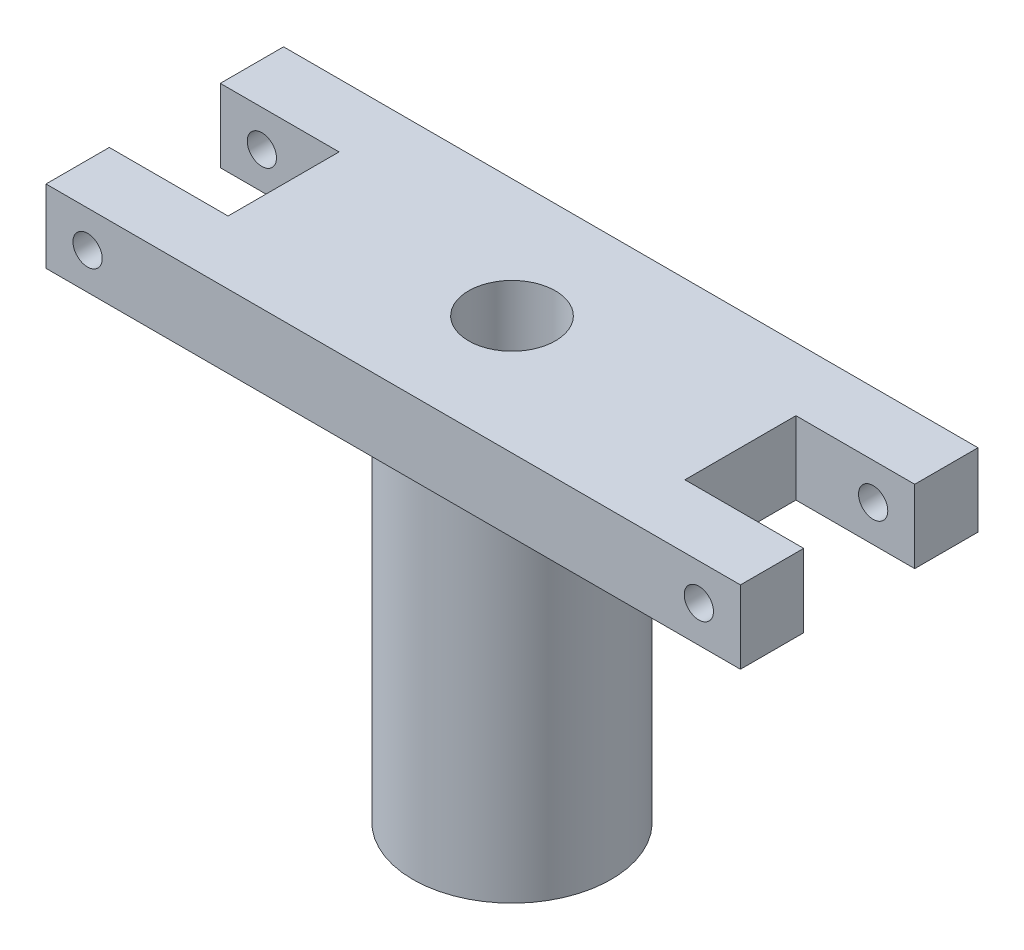
ISO-10303-21;
HEADER;
FILE_DESCRIPTION(('STEP AP214'),'2;1');
FILE_NAME('part.step','',(''),(''),'','','');
FILE_SCHEMA(('AUTOMOTIVE_DESIGN { 1 0 10303 214 1 1 1 1 }'));
ENDSEC;
DATA;
#1=APPLICATION_CONTEXT('core data for automotive mechanical design processes');
#2=APPLICATION_PROTOCOL_DEFINITION('international standard','automotive_design',2000,#1);
#3=PRODUCT_CONTEXT('',#1,'mechanical');
#4=PRODUCT('Part','Part','',(#3));
#5=PRODUCT_RELATED_PRODUCT_CATEGORY('part','',(#4));
#6=PRODUCT_DEFINITION_FORMATION('','',#4);
#7=PRODUCT_DEFINITION_CONTEXT('part definition',#1,'design');
#8=PRODUCT_DEFINITION('design','',#6,#7);
#9=PRODUCT_DEFINITION_SHAPE('','',#8);
#10=(LENGTH_UNIT() NAMED_UNIT(*) SI_UNIT(.MILLI.,.METRE.));
#11=(NAMED_UNIT(*) PLANE_ANGLE_UNIT() SI_UNIT($,.RADIAN.));
#12=(NAMED_UNIT(*) SI_UNIT($,.STERADIAN.) SOLID_ANGLE_UNIT());
#13=UNCERTAINTY_MEASURE_WITH_UNIT(LENGTH_MEASURE(1.E-05),#10,'distance_accuracy_value','');
#14=(GEOMETRIC_REPRESENTATION_CONTEXT(3) GLOBAL_UNCERTAINTY_ASSIGNED_CONTEXT((#13)) GLOBAL_UNIT_ASSIGNED_CONTEXT((#10,
#11,#12)) REPRESENTATION_CONTEXT('',''));
#15=CARTESIAN_POINT('',(0.,0.,0.));
#16=DIRECTION('',(0.,0.,1.));
#17=DIRECTION('',(1.,0.,0.));
#18=AXIS2_PLACEMENT_3D('',#15,#16,#17);
#19=CARTESIAN_POINT('',(-38.,48.,13.));
#20=DIRECTION('',(1.,0.,0.));
#21=DIRECTION('',(0.,0.,-1.));
#22=AXIS2_PLACEMENT_3D('',#19,#20,#21);
#23=PLANE('',#22);
#24=DIRECTION('',(0.,0.,1.));
#25=VECTOR('',#24,1.);
#26=CARTESIAN_POINT('',(-38.,40.,13.));
#27=LINE('',#26,#25);
#28=CARTESIAN_POINT('',(-38.,40.,-13.));
#29=VERTEX_POINT('',#28);
#30=CARTESIAN_POINT('',(-38.,40.,-6.075));
#31=VERTEX_POINT('',#30);
#32=EDGE_CURVE('E251',#29,#31,#27,.T.);
#33=ORIENTED_EDGE('',*,*,#32,.T.);
#34=DIRECTION('',(0.,-1.,0.));
#35=VECTOR('',#34,1.);
#36=CARTESIAN_POINT('',(-38.,48.,-6.075));
#37=LINE('',#36,#35);
#38=CARTESIAN_POINT('',(-38.,48.,-6.075));
#39=VERTEX_POINT('',#38);
#40=EDGE_CURVE('E195',#39,#31,#37,.T.);
#41=ORIENTED_EDGE('',*,*,#40,.F.);
#42=DIRECTION('',(0.,0.,1.));
#43=VECTOR('',#42,1.);
#44=CARTESIAN_POINT('',(-38.,48.,13.));
#45=LINE('',#44,#43);
#46=CARTESIAN_POINT('',(-38.,48.,-13.));
#47=VERTEX_POINT('',#46);
#48=EDGE_CURVE('E239',#47,#39,#45,.T.);
#49=ORIENTED_EDGE('',*,*,#48,.F.);
#50=DIRECTION('',(0.,-1.,0.));
#51=VECTOR('',#50,1.);
#52=CARTESIAN_POINT('',(-38.,48.,-13.));
#53=LINE('',#52,#51);
#54=EDGE_CURVE('E250',#47,#29,#53,.T.);
#55=ORIENTED_EDGE('',*,*,#54,.T.);
#56=EDGE_LOOP('',(#33,#41,#49,#55));
#57=FACE_BOUND('',#56,.T.);
#58=ADVANCED_FACE('F35',(#57),#23,.F.);
#59=CARTESIAN_POINT('',(-33.45,44.,-13.));
#60=DIRECTION('',(0.,0.,1.));
#61=DIRECTION('',(1.,0.,0.));
#62=AXIS2_PLACEMENT_3D('',#59,#60,#61);
#63=CYLINDRICAL_SURFACE('',#62,1.6);
#64=CARTESIAN_POINT('',(-33.45,44.,-6.075));
#65=DIRECTION('',(0.,0.,-1.));
#66=DIRECTION('',(-1.,0.,0.));
#67=AXIS2_PLACEMENT_3D('',#64,#65,#66);
#68=CIRCLE('',#67,1.6);
#69=CARTESIAN_POINT('',(-35.05,44.,-6.075));
#70=VERTEX_POINT('',#69);
#71=EDGE_CURVE('E39',#70,#70,#68,.F.);
#72=ORIENTED_EDGE('',*,*,#71,.T.);
#73=EDGE_LOOP('',(#72));
#74=FACE_BOUND('',#73,.T.);
#75=CARTESIAN_POINT('',(-33.45,44.,-13.));
#76=DIRECTION('',(0.,0.,1.));
#77=DIRECTION('',(1.,0.,0.));
#78=AXIS2_PLACEMENT_3D('',#75,#76,#77);
#79=CIRCLE('',#78,1.6);
#80=CARTESIAN_POINT('',(-31.85,44.,-13.));
#81=VERTEX_POINT('',#80);
#82=EDGE_CURVE('E230',#81,#81,#79,.T.);
#83=ORIENTED_EDGE('',*,*,#82,.F.);
#84=EDGE_LOOP('',(#83));
#85=FACE_BOUND('',#84,.T.);
#86=ADVANCED_FACE('F341',(#74,#85),#63,.F.);
#87=CARTESIAN_POINT('',(38.,48.,13.));
#88=DIRECTION('',(-1.,0.,0.));
#89=DIRECTION('',(0.,0.,1.));
#90=AXIS2_PLACEMENT_3D('',#87,#88,#89);
#91=PLANE('',#90);
#92=DIRECTION('',(0.,0.,-1.));
#93=VECTOR('',#92,1.);
#94=CARTESIAN_POINT('',(38.,40.,13.));
#95=LINE('',#94,#93);
#96=CARTESIAN_POINT('',(38.,40.,13.));
#97=VERTEX_POINT('',#96);
#98=CARTESIAN_POINT('',(38.,40.,6.075));
#99=VERTEX_POINT('',#98);
#100=EDGE_CURVE('E257',#97,#99,#95,.T.);
#101=ORIENTED_EDGE('',*,*,#100,.T.);
#102=DIRECTION('',(0.,-1.,0.));
#103=VECTOR('',#102,1.);
#104=CARTESIAN_POINT('',(38.,48.,6.075));
#105=LINE('',#104,#103);
#106=CARTESIAN_POINT('',(38.,48.,6.075));
#107=VERTEX_POINT('',#106);
#108=EDGE_CURVE('E218',#107,#99,#105,.T.);
#109=ORIENTED_EDGE('',*,*,#108,.F.);
#110=DIRECTION('',(0.,0.,-1.));
#111=VECTOR('',#110,1.);
#112=CARTESIAN_POINT('',(38.,48.,13.));
#113=LINE('',#112,#111);
#114=CARTESIAN_POINT('',(38.,48.,13.));
#115=VERTEX_POINT('',#114);
#116=EDGE_CURVE('E245',#115,#107,#113,.T.);
#117=ORIENTED_EDGE('',*,*,#116,.F.);
#118=DIRECTION('',(0.,-1.,0.));
#119=VECTOR('',#118,1.);
#120=CARTESIAN_POINT('',(38.,48.,13.));
#121=LINE('',#120,#119);
#122=EDGE_CURVE('E267',#115,#97,#121,.T.);
#123=ORIENTED_EDGE('',*,*,#122,.T.);
#124=EDGE_LOOP('',(#101,#109,#117,#123));
#125=FACE_BOUND('',#124,.T.);
#126=ADVANCED_FACE('F364',(#125),#91,.F.);
#127=CARTESIAN_POINT('',(33.45,44.,-13.));
#128=DIRECTION('',(0.,0.,1.));
#129=DIRECTION('',(1.,0.,0.));
#130=AXIS2_PLACEMENT_3D('',#127,#128,#129);
#131=CYLINDRICAL_SURFACE('',#130,1.6);
#132=CARTESIAN_POINT('',(33.45,44.,6.075));
#133=DIRECTION('',(0.,0.,1.));
#134=DIRECTION('',(1.,0.,0.));
#135=AXIS2_PLACEMENT_3D('',#132,#133,#134);
#136=CIRCLE('',#135,1.6);
#137=CARTESIAN_POINT('',(35.05,44.,6.075));
#138=VERTEX_POINT('',#137);
#139=EDGE_CURVE('E229',#138,#138,#136,.F.);
#140=ORIENTED_EDGE('',*,*,#139,.T.);
#141=EDGE_LOOP('',(#140));
#142=FACE_BOUND('',#141,.T.);
#143=CARTESIAN_POINT('',(33.45,44.,13.));
#144=DIRECTION('',(0.,0.,1.));
#145=DIRECTION('',(1.,0.,0.));
#146=AXIS2_PLACEMENT_3D('',#143,#144,#145);
#147=CIRCLE('',#146,1.6);
#148=CARTESIAN_POINT('',(35.05,44.,13.));
#149=VERTEX_POINT('',#148);
#150=EDGE_CURVE('E226',#149,#149,#147,.T.);
#151=ORIENTED_EDGE('',*,*,#150,.T.);
#152=EDGE_LOOP('',(#151));
#153=FACE_BOUND('',#152,.T.);
#154=ADVANCED_FACE('F419',(#142,#153),#131,.F.);
#155=CARTESIAN_POINT('',(0.,40.,0.));
#156=DIRECTION('',(0.,-1.,0.));
#157=DIRECTION('',(0.,0.,-1.));
#158=AXIS2_PLACEMENT_3D('',#155,#156,#157);
#159=CYLINDRICAL_SURFACE('',#158,10.85);
#160=CARTESIAN_POINT('',(0.,40.,0.));
#161=DIRECTION('',(0.,1.,0.));
#162=DIRECTION('',(0.,0.,1.));
#163=AXIS2_PLACEMENT_3D('',#160,#161,#162);
#164=CIRCLE('',#163,10.85);
#165=CARTESIAN_POINT('',(0.,40.,10.85));
#166=VERTEX_POINT('',#165);
#167=EDGE_CURVE('E11',#166,#166,#164,.T.);
#168=ORIENTED_EDGE('',*,*,#167,.F.);
#169=EDGE_LOOP('',(#168));
#170=FACE_BOUND('',#169,.T.);
#171=CARTESIAN_POINT('',(0.,0.,0.));
#172=DIRECTION('',(0.,1.,0.));
#173=DIRECTION('',(0.,0.,1.));
#174=AXIS2_PLACEMENT_3D('',#171,#172,#173);
#175=CIRCLE('',#174,10.85);
#176=CARTESIAN_POINT('',(0.,0.,10.85));
#177=VERTEX_POINT('',#176);
#178=EDGE_CURVE('E44',#177,#177,#175,.T.);
#179=ORIENTED_EDGE('',*,*,#178,.T.);
#180=EDGE_LOOP('',(#179));
#181=FACE_BOUND('',#180,.T.);
#182=ADVANCED_FACE('F37',(#170,#181),#159,.T.);
#183=CARTESIAN_POINT('',(0.,0.,0.));
#184=DIRECTION('',(0.,1.,0.));
#185=DIRECTION('',(0.,0.,1.));
#186=AXIS2_PLACEMENT_3D('',#183,#184,#185);
#187=PLANE('',#186);
#188=DIRECTION('',(-0.145360838078503,0.,-0.989378707448829));
#189=VECTOR('',#188,1.);
#190=CARTESIAN_POINT('',(-5.73995366520788,0.,4.54261289581962));
#191=LINE('',#190,#189);
#192=CARTESIAN_POINT('',(-5.73995366520787,0.,4.54261289581962));
#193=VERTEX_POINT('',#192);
#194=CARTESIAN_POINT('',(-6.80399499994252,0.,-2.69963924270581));
#195=VERTEX_POINT('',#194);
#196=EDGE_CURVE('E304',#193,#195,#191,.T.);
#197=ORIENTED_EDGE('',*,*,#196,.F.);
#198=DIRECTION('',(-0.92950751365335,0.,-0.368803175233034));
#199=VECTOR('',#198,1.);
#200=CARTESIAN_POINT('',(1.06404133473464,0.,7.24225213852543));
#201=LINE('',#200,#199);
#202=CARTESIAN_POINT('',(1.06404133473464,0.,7.24225213852543));
#203=VERTEX_POINT('',#202);
#204=EDGE_CURVE('E282',#203,#193,#201,.T.);
#205=ORIENTED_EDGE('',*,*,#204,.F.);
#206=DIRECTION('',(-0.784146675574846,0.,0.620575532215795));
#207=VECTOR('',#206,1.);
#208=CARTESIAN_POINT('',(6.80399499994252,0.,2.69963924270581));
#209=LINE('',#208,#207);
#210=CARTESIAN_POINT('',(6.80399499994252,0.,2.69963924270581));
#211=VERTEX_POINT('',#210);
#212=EDGE_CURVE('E287',#211,#203,#209,.T.);
#213=ORIENTED_EDGE('',*,*,#212,.F.);
#214=DIRECTION('',(0.145360838078503,0.,0.989378707448829));
#215=VECTOR('',#214,1.);
#216=CARTESIAN_POINT('',(5.73995366520787,0.,-4.54261289581961));
#217=LINE('',#216,#215);
#218=CARTESIAN_POINT('',(5.73995366520787,0.,-4.54261289581961));
#219=VERTEX_POINT('',#218);
#220=EDGE_CURVE('E313',#219,#211,#217,.T.);
#221=ORIENTED_EDGE('',*,*,#220,.F.);
#222=DIRECTION('',(0.92950751365335,0.,0.368803175233034));
#223=VECTOR('',#222,1.);
#224=CARTESIAN_POINT('',(-1.06404133473465,0.,-7.24225213852542));
#225=LINE('',#224,#223);
#226=CARTESIAN_POINT('',(-1.06404133473465,0.,-7.24225213852542));
#227=VERTEX_POINT('',#226);
#228=EDGE_CURVE('E310',#227,#219,#225,.T.);
#229=ORIENTED_EDGE('',*,*,#228,.F.);
#230=DIRECTION('',(0.784146675574846,0.,-0.620575532215795));
#231=VECTOR('',#230,1.);
#232=CARTESIAN_POINT('',(-6.80399499994252,0.,-2.69963924270581));
#233=LINE('',#232,#231);
#234=EDGE_CURVE('E307',#195,#227,#233,.T.);
#235=ORIENTED_EDGE('',*,*,#234,.F.);
#236=EDGE_LOOP('',(#197,#205,#213,#221,#229,#235));
#237=FACE_BOUND('',#236,.T.);
#238=ORIENTED_EDGE('',*,*,#178,.F.);
#239=EDGE_LOOP('',(#238));
#240=FACE_BOUND('',#239,.T.);
#241=ADVANCED_FACE('F418',(#237,#240),#187,.F.);
#242=CARTESIAN_POINT('',(1.06404133473464,18.,7.24225213852543));
#243=DIRECTION('',(-0.368803175233034,0.,0.92950751365335));
#244=DIRECTION('',(0.92950751365335,0.,0.368803175233034));
#245=AXIS2_PLACEMENT_3D('',#242,#243,#244);
#246=PLANE('',#245);
#247=ORIENTED_EDGE('',*,*,#204,.T.);
#248=DIRECTION('',(0.,-1.,0.));
#249=VECTOR('',#248,1.);
#250=CARTESIAN_POINT('',(-5.73995366520788,18.,4.54261289581962));
#251=LINE('',#250,#249);
#252=CARTESIAN_POINT('',(-5.73995366520788,18.,4.54261289581962));
#253=VERTEX_POINT('',#252);
#254=EDGE_CURVE('E302',#253,#193,#251,.T.);
#255=ORIENTED_EDGE('',*,*,#254,.F.);
#256=DIRECTION('',(-0.92950751365335,0.,-0.368803175233034));
#257=VECTOR('',#256,1.);
#258=CARTESIAN_POINT('',(1.06404133473464,18.,7.24225213852543));
#259=LINE('',#258,#257);
#260=CARTESIAN_POINT('',(1.06404133473464,18.,7.24225213852543));
#261=VERTEX_POINT('',#260);
#262=EDGE_CURVE('E283',#261,#253,#259,.T.);
#263=ORIENTED_EDGE('',*,*,#262,.F.);
#264=DIRECTION('',(0.,-1.,0.));
#265=VECTOR('',#264,1.);
#266=CARTESIAN_POINT('',(1.06404133473464,18.,7.24225213852543));
#267=LINE('',#266,#265);
#268=EDGE_CURVE('E318',#261,#203,#267,.T.);
#269=ORIENTED_EDGE('',*,*,#268,.T.);
#270=EDGE_LOOP('',(#247,#255,#263,#269));
#271=FACE_BOUND('',#270,.T.);
#272=ADVANCED_FACE('F423',(#271),#246,.F.);
#273=CARTESIAN_POINT('',(6.80399499994252,18.,2.69963924270581));
#274=DIRECTION('',(0.620575532215795,0.,0.784146675574846));
#275=DIRECTION('',(0.784146675574846,0.,-0.620575532215795));
#276=AXIS2_PLACEMENT_3D('',#273,#274,#275);
#277=PLANE('',#276);
#278=ORIENTED_EDGE('',*,*,#212,.T.);
#279=ORIENTED_EDGE('',*,*,#268,.F.);
#280=DIRECTION('',(-0.784146675574846,0.,0.620575532215795));
#281=VECTOR('',#280,1.);
#282=CARTESIAN_POINT('',(6.80399499994252,18.,2.69963924270581));
#283=LINE('',#282,#281);
#284=CARTESIAN_POINT('',(6.80399499994252,18.,2.69963924270581));
#285=VERTEX_POINT('',#284);
#286=EDGE_CURVE('E299',#285,#261,#283,.T.);
#287=ORIENTED_EDGE('',*,*,#286,.F.);
#288=DIRECTION('',(0.,-1.,0.));
#289=VECTOR('',#288,1.);
#290=CARTESIAN_POINT('',(6.80399499994252,18.,2.69963924270581));
#291=LINE('',#290,#289);
#292=EDGE_CURVE('E320',#285,#211,#291,.T.);
#293=ORIENTED_EDGE('',*,*,#292,.T.);
#294=EDGE_LOOP('',(#278,#279,#287,#293));
#295=FACE_BOUND('',#294,.T.);
#296=ADVANCED_FACE('F428',(#295),#277,.F.);
#297=CARTESIAN_POINT('',(5.73995366520787,18.,-4.54261289581961));
#298=DIRECTION('',(0.989378707448829,0.,-0.145360838078503));
#299=DIRECTION('',(-0.145360838078503,0.,-0.989378707448829));
#300=AXIS2_PLACEMENT_3D('',#297,#298,#299);
#301=PLANE('',#300);
#302=ORIENTED_EDGE('',*,*,#220,.T.);
#303=ORIENTED_EDGE('',*,*,#292,.F.);
#304=DIRECTION('',(0.145360838078503,0.,0.989378707448829));
#305=VECTOR('',#304,1.);
#306=CARTESIAN_POINT('',(5.73995366520787,18.,-4.54261289581961));
#307=LINE('',#306,#305);
#308=CARTESIAN_POINT('',(5.73995366520787,18.,-4.54261289581961));
#309=VERTEX_POINT('',#308);
#310=EDGE_CURVE('E296',#309,#285,#307,.T.);
#311=ORIENTED_EDGE('',*,*,#310,.F.);
#312=DIRECTION('',(0.,-1.,0.));
#313=VECTOR('',#312,1.);
#314=CARTESIAN_POINT('',(5.73995366520787,18.,-4.54261289581961));
#315=LINE('',#314,#313);
#316=EDGE_CURVE('E322',#309,#219,#315,.T.);
#317=ORIENTED_EDGE('',*,*,#316,.T.);
#318=EDGE_LOOP('',(#302,#303,#311,#317));
#319=FACE_BOUND('',#318,.T.);
#320=ADVANCED_FACE('F445',(#319),#301,.F.);
#321=CARTESIAN_POINT('',(-1.06404133473465,18.,-7.24225213852542));
#322=DIRECTION('',(0.368803175233034,0.,-0.92950751365335));
#323=DIRECTION('',(-0.92950751365335,0.,-0.368803175233034));
#324=AXIS2_PLACEMENT_3D('',#321,#322,#323);
#325=PLANE('',#324);
#326=ORIENTED_EDGE('',*,*,#228,.T.);
#327=ORIENTED_EDGE('',*,*,#316,.F.);
#328=DIRECTION('',(0.92950751365335,0.,0.368803175233034));
#329=VECTOR('',#328,1.);
#330=CARTESIAN_POINT('',(-1.06404133473465,18.,-7.24225213852542));
#331=LINE('',#330,#329);
#332=CARTESIAN_POINT('',(-1.06404133473465,18.,-7.24225213852542));
#333=VERTEX_POINT('',#332);
#334=EDGE_CURVE('E293',#333,#309,#331,.T.);
#335=ORIENTED_EDGE('',*,*,#334,.F.);
#336=DIRECTION('',(0.,-1.,0.));
#337=VECTOR('',#336,1.);
#338=CARTESIAN_POINT('',(-1.06404133473465,18.,-7.24225213852542));
#339=LINE('',#338,#337);
#340=EDGE_CURVE('E324',#333,#227,#339,.T.);
#341=ORIENTED_EDGE('',*,*,#340,.T.);
#342=EDGE_LOOP('',(#326,#327,#335,#341));
#343=FACE_BOUND('',#342,.T.);
#344=ADVANCED_FACE('F441',(#343),#325,.F.);
#345=CARTESIAN_POINT('',(-6.80399499994252,18.,-2.69963924270581));
#346=DIRECTION('',(-0.620575532215795,0.,-0.784146675574846));
#347=DIRECTION('',(-0.784146675574846,0.,0.620575532215795));
#348=AXIS2_PLACEMENT_3D('',#345,#346,#347);
#349=PLANE('',#348);
#350=ORIENTED_EDGE('',*,*,#234,.T.);
#351=ORIENTED_EDGE('',*,*,#340,.F.);
#352=DIRECTION('',(0.784146675574846,0.,-0.620575532215795));
#353=VECTOR('',#352,1.);
#354=CARTESIAN_POINT('',(-6.80399499994252,18.,-2.69963924270581));
#355=LINE('',#354,#353);
#356=CARTESIAN_POINT('',(-6.80399499994252,18.,-2.69963924270581));
#357=VERTEX_POINT('',#356);
#358=EDGE_CURVE('E290',#357,#333,#355,.T.);
#359=ORIENTED_EDGE('',*,*,#358,.F.);
#360=DIRECTION('',(0.,-1.,0.));
#361=VECTOR('',#360,1.);
#362=CARTESIAN_POINT('',(-6.80399499994252,18.,-2.69963924270581));
#363=LINE('',#362,#361);
#364=EDGE_CURVE('E326',#357,#195,#363,.T.);
#365=ORIENTED_EDGE('',*,*,#364,.T.);
#366=EDGE_LOOP('',(#350,#351,#359,#365));
#367=FACE_BOUND('',#366,.T.);
#368=ADVANCED_FACE('F437',(#367),#349,.F.);
#369=CARTESIAN_POINT('',(-5.73995366520788,18.,4.54261289581962));
#370=DIRECTION('',(-0.989378707448829,0.,0.145360838078503));
#371=DIRECTION('',(0.145360838078503,0.,0.989378707448829));
#372=AXIS2_PLACEMENT_3D('',#369,#370,#371);
#373=PLANE('',#372);
#374=ORIENTED_EDGE('',*,*,#196,.T.);
#375=ORIENTED_EDGE('',*,*,#364,.F.);
#376=DIRECTION('',(-0.145360838078503,0.,-0.989378707448829));
#377=VECTOR('',#376,1.);
#378=CARTESIAN_POINT('',(-5.73995366520788,18.,4.54261289581962));
#379=LINE('',#378,#377);
#380=EDGE_CURVE('E286',#253,#357,#379,.T.);
#381=ORIENTED_EDGE('',*,*,#380,.F.);
#382=ORIENTED_EDGE('',*,*,#254,.T.);
#383=EDGE_LOOP('',(#374,#375,#381,#382));
#384=FACE_BOUND('',#383,.T.);
#385=ADVANCED_FACE('F433',(#384),#373,.F.);
#386=CARTESIAN_POINT('',(0.,18.,0.));
#387=DIRECTION('',(0.,-1.,0.));
#388=DIRECTION('',(0.,0.,-1.));
#389=AXIS2_PLACEMENT_3D('',#386,#387,#388);
#390=PLANE('',#389);
#391=CARTESIAN_POINT('',(0.,18.,0.));
#392=DIRECTION('',(0.,1.,0.));
#393=DIRECTION('',(0.,0.,1.));
#394=AXIS2_PLACEMENT_3D('',#391,#392,#393);
#395=CIRCLE('',#394,2.1);
#396=CARTESIAN_POINT('',(0.,18.,2.1));
#397=VERTEX_POINT('',#396);
#398=EDGE_CURVE('E274',#397,#397,#395,.T.);
#399=ORIENTED_EDGE('',*,*,#398,.T.);
#400=EDGE_LOOP('',(#399));
#401=FACE_BOUND('',#400,.T.);
#402=ORIENTED_EDGE('',*,*,#262,.T.);
#403=ORIENTED_EDGE('',*,*,#380,.T.);
#404=ORIENTED_EDGE('',*,*,#358,.T.);
#405=ORIENTED_EDGE('',*,*,#334,.T.);
#406=ORIENTED_EDGE('',*,*,#310,.T.);
#407=ORIENTED_EDGE('',*,*,#286,.T.);
#408=EDGE_LOOP('',(#402,#403,#404,#405,#406,#407));
#409=FACE_BOUND('',#408,.T.);
#410=ADVANCED_FACE('F436',(#401,#409),#390,.T.);
#411=CARTESIAN_POINT('',(0.,22.,0.));
#412=DIRECTION('',(0.,1.,0.));
#413=DIRECTION('',(0.,0.,1.));
#414=AXIS2_PLACEMENT_3D('',#411,#412,#413);
#415=CYLINDRICAL_SURFACE('',#414,4.75);
#416=CARTESIAN_POINT('',(0.,22.,0.));
#417=DIRECTION('',(0.,1.,0.));
#418=DIRECTION('',(0.,0.,1.));
#419=AXIS2_PLACEMENT_3D('',#416,#417,#418);
#420=CIRCLE('',#419,4.75);
#421=CARTESIAN_POINT('',(0.,22.,4.75));
#422=VERTEX_POINT('',#421);
#423=EDGE_CURVE('E277',#422,#422,#420,.T.);
#424=ORIENTED_EDGE('',*,*,#423,.F.);
#425=EDGE_LOOP('',(#424));
#426=FACE_BOUND('',#425,.T.);
#427=CARTESIAN_POINT('',(0.,48.,0.));
#428=DIRECTION('',(0.,1.,0.));
#429=DIRECTION('',(0.,0.,1.));
#430=AXIS2_PLACEMENT_3D('',#427,#428,#429);
#431=CIRCLE('',#430,4.75);
#432=CARTESIAN_POINT('',(0.,48.,4.75));
#433=VERTEX_POINT('',#432);
#434=EDGE_CURVE('E233',#433,#433,#431,.T.);
#435=ORIENTED_EDGE('',*,*,#434,.T.);
#436=EDGE_LOOP('',(#435));
#437=FACE_BOUND('',#436,.T.);
#438=ADVANCED_FACE('F455',(#426,#437),#415,.F.);
#439=CARTESIAN_POINT('',(0.,22.,0.));
#440=DIRECTION('',(0.,1.,0.));
#441=DIRECTION('',(0.,0.,1.));
#442=AXIS2_PLACEMENT_3D('',#439,#440,#441);
#443=PLANE('',#442);
#444=CARTESIAN_POINT('',(0.,22.,0.));
#445=DIRECTION('',(0.,1.,0.));
#446=DIRECTION('',(0.,0.,1.));
#447=AXIS2_PLACEMENT_3D('',#444,#445,#446);
#448=CIRCLE('',#447,2.1);
#449=CARTESIAN_POINT('',(0.,22.,2.1));
#450=VERTEX_POINT('',#449);
#451=EDGE_CURVE('E273',#450,#450,#448,.T.);
#452=ORIENTED_EDGE('',*,*,#451,.F.);
#453=EDGE_LOOP('',(#452));
#454=FACE_BOUND('',#453,.T.);
#455=ORIENTED_EDGE('',*,*,#423,.T.);
#456=EDGE_LOOP('',(#455));
#457=FACE_BOUND('',#456,.T.);
#458=ADVANCED_FACE('F459',(#454,#457),#443,.T.);
#459=CARTESIAN_POINT('',(0.,18.,0.));
#460=DIRECTION('',(0.,1.,0.));
#461=DIRECTION('',(0.,0.,1.));
#462=AXIS2_PLACEMENT_3D('',#459,#460,#461);
#463=CYLINDRICAL_SURFACE('',#462,2.1);
#464=ORIENTED_EDGE('',*,*,#398,.F.);
#465=EDGE_LOOP('',(#464));
#466=FACE_BOUND('',#465,.T.);
#467=ORIENTED_EDGE('',*,*,#451,.T.);
#468=EDGE_LOOP('',(#467));
#469=FACE_BOUND('',#468,.T.);
#470=ADVANCED_FACE('F379',(#466,#469),#463,.F.);
#471=CARTESIAN_POINT('',(0.,40.,0.));
#472=DIRECTION('',(0.,1.,0.));
#473=DIRECTION('',(0.,0.,1.));
#474=AXIS2_PLACEMENT_3D('',#471,#472,#473);
#475=PLANE('',#474);
#476=DIRECTION('',(0.,0.,1.));
#477=VECTOR('',#476,1.);
#478=CARTESIAN_POINT('',(-25.,40.,-6.075));
#479=LINE('',#478,#477);
#480=CARTESIAN_POINT('',(-25.,40.,-6.075));
#481=VERTEX_POINT('',#480);
#482=CARTESIAN_POINT('',(-25.,40.,6.075));
#483=VERTEX_POINT('',#482);
#484=EDGE_CURVE('E170',#481,#483,#479,.T.);
#485=ORIENTED_EDGE('',*,*,#484,.F.);
#486=DIRECTION('',(1.,0.,0.));
#487=VECTOR('',#486,1.);
#488=CARTESIAN_POINT('',(-25.,40.,-6.075));
#489=LINE('',#488,#487);
#490=EDGE_CURVE('E183',#31,#481,#489,.T.);
#491=ORIENTED_EDGE('',*,*,#490,.F.);
#492=ORIENTED_EDGE('',*,*,#32,.F.);
#493=DIRECTION('',(-1.,0.,0.));
#494=VECTOR('',#493,1.);
#495=CARTESIAN_POINT('',(38.,40.,-13.));
#496=LINE('',#495,#494);
#497=CARTESIAN_POINT('',(38.,40.,-13.));
#498=VERTEX_POINT('',#497);
#499=EDGE_CURVE('E260',#498,#29,#496,.T.);
#500=ORIENTED_EDGE('',*,*,#499,.F.);
#501=CARTESIAN_POINT('',(38.,40.,-6.075));
#502=VERTEX_POINT('',#501);
#503=EDGE_CURVE('E256',#502,#498,#95,.T.);
#504=ORIENTED_EDGE('',*,*,#503,.F.);
#505=DIRECTION('',(1.,0.,0.));
#506=VECTOR('',#505,1.);
#507=CARTESIAN_POINT('',(25.,40.,-6.075));
#508=LINE('',#507,#506);
#509=CARTESIAN_POINT('',(25.,40.,-6.075));
#510=VERTEX_POINT('',#509);
#511=EDGE_CURVE('E211',#510,#502,#508,.T.);
#512=ORIENTED_EDGE('',*,*,#511,.F.);
#513=DIRECTION('',(0.,0.,-1.));
#514=VECTOR('',#513,1.);
#515=CARTESIAN_POINT('',(25.,40.,6.075));
#516=LINE('',#515,#514);
#517=CARTESIAN_POINT('',(25.,40.,6.075));
#518=VERTEX_POINT('',#517);
#519=EDGE_CURVE('E208',#518,#510,#516,.T.);
#520=ORIENTED_EDGE('',*,*,#519,.F.);
#521=DIRECTION('',(-1.,0.,0.));
#522=VECTOR('',#521,1.);
#523=CARTESIAN_POINT('',(25.,40.,6.075));
#524=LINE('',#523,#522);
#525=EDGE_CURVE('E202',#99,#518,#524,.T.);
#526=ORIENTED_EDGE('',*,*,#525,.F.);
#527=ORIENTED_EDGE('',*,*,#100,.F.);
#528=DIRECTION('',(1.,0.,0.));
#529=VECTOR('',#528,1.);
#530=CARTESIAN_POINT('',(38.,40.,13.));
#531=LINE('',#530,#529);
#532=CARTESIAN_POINT('',(-38.,40.,13.));
#533=VERTEX_POINT('',#532);
#534=EDGE_CURVE('E254',#533,#97,#531,.T.);
#535=ORIENTED_EDGE('',*,*,#534,.F.);
#536=CARTESIAN_POINT('',(-38.,40.,6.075));
#537=VERTEX_POINT('',#536);
#538=EDGE_CURVE('E238',#537,#533,#27,.T.);
#539=ORIENTED_EDGE('',*,*,#538,.F.);
#540=DIRECTION('',(-1.,0.,0.));
#541=VECTOR('',#540,1.);
#542=CARTESIAN_POINT('',(-25.,40.,6.075));
#543=LINE('',#542,#541);
#544=EDGE_CURVE('E186',#483,#537,#543,.T.);
#545=ORIENTED_EDGE('',*,*,#544,.F.);
#546=EDGE_LOOP('',(#485,#491,#492,#500,#504,#512,#520,#526,#527,#535,#539,#545));
#547=FACE_BOUND('',#546,.T.);
#548=ORIENTED_EDGE('',*,*,#167,.T.);
#549=EDGE_LOOP('',(#548));
#550=FACE_BOUND('',#549,.T.);
#551=ADVANCED_FACE('F371',(#547,#550),#475,.F.);
#552=CARTESIAN_POINT('',(-38.,48.,6.075));
#553=VERTEX_POINT('',#552);
#554=CARTESIAN_POINT('',(-38.,48.,13.));
#555=VERTEX_POINT('',#554);
#556=EDGE_CURVE('E242',#553,#555,#45,.T.);
#557=ORIENTED_EDGE('',*,*,#556,.F.);
#558=DIRECTION('',(0.,-1.,0.));
#559=VECTOR('',#558,1.);
#560=CARTESIAN_POINT('',(-38.,48.,6.075));
#561=LINE('',#560,#559);
#562=EDGE_CURVE('E52',#553,#537,#561,.T.);
#563=ORIENTED_EDGE('',*,*,#562,.T.);
#564=ORIENTED_EDGE('',*,*,#538,.T.);
#565=DIRECTION('',(0.,-1.,0.));
#566=VECTOR('',#565,1.);
#567=CARTESIAN_POINT('',(-38.,48.,13.));
#568=LINE('',#567,#566);
#569=EDGE_CURVE('E270',#555,#533,#568,.T.);
#570=ORIENTED_EDGE('',*,*,#569,.F.);
#571=EDGE_LOOP('',(#557,#563,#564,#570));
#572=FACE_BOUND('',#571,.T.);
#573=ADVANCED_FACE('F360',(#572),#23,.F.);
#574=CARTESIAN_POINT('',(38.,48.,13.));
#575=DIRECTION('',(0.,0.,-1.));
#576=DIRECTION('',(-1.,0.,0.));
#577=AXIS2_PLACEMENT_3D('',#574,#575,#576);
#578=PLANE('',#577);
#579=ORIENTED_EDGE('',*,*,#150,.F.);
#580=EDGE_LOOP('',(#579));
#581=FACE_BOUND('',#580,.T.);
#582=CARTESIAN_POINT('',(-33.45,44.,13.));
#583=DIRECTION('',(0.,0.,1.));
#584=DIRECTION('',(1.,0.,0.));
#585=AXIS2_PLACEMENT_3D('',#582,#583,#584);
#586=CIRCLE('',#585,1.6);
#587=CARTESIAN_POINT('',(-31.85,44.,13.));
#588=VERTEX_POINT('',#587);
#589=EDGE_CURVE('E225',#588,#588,#586,.T.);
#590=ORIENTED_EDGE('',*,*,#589,.F.);
#591=EDGE_LOOP('',(#590));
#592=FACE_BOUND('',#591,.T.);
#593=ORIENTED_EDGE('',*,*,#534,.T.);
#594=ORIENTED_EDGE('',*,*,#122,.F.);
#595=DIRECTION('',(1.,0.,0.));
#596=VECTOR('',#595,1.);
#597=CARTESIAN_POINT('',(38.,48.,13.));
#598=LINE('',#597,#596);
#599=EDGE_CURVE('E241',#555,#115,#598,.T.);
#600=ORIENTED_EDGE('',*,*,#599,.F.);
#601=ORIENTED_EDGE('',*,*,#569,.T.);
#602=EDGE_LOOP('',(#593,#594,#600,#601));
#603=FACE_BOUND('',#602,.T.);
#604=ADVANCED_FACE('F370',(#581,#592,#603),#578,.F.);
#605=CARTESIAN_POINT('',(38.,48.,-6.075));
#606=VERTEX_POINT('',#605);
#607=CARTESIAN_POINT('',(38.,48.,-13.));
#608=VERTEX_POINT('',#607);
#609=EDGE_CURVE('E244',#606,#608,#113,.T.);
#610=ORIENTED_EDGE('',*,*,#609,.F.);
#611=DIRECTION('',(0.,-1.,0.));
#612=VECTOR('',#611,1.);
#613=CARTESIAN_POINT('',(38.,48.,-6.075));
#614=LINE('',#613,#612);
#615=EDGE_CURVE('E60',#606,#502,#614,.T.);
#616=ORIENTED_EDGE('',*,*,#615,.T.);
#617=ORIENTED_EDGE('',*,*,#503,.T.);
#618=DIRECTION('',(0.,-1.,0.));
#619=VECTOR('',#618,1.);
#620=CARTESIAN_POINT('',(38.,48.,-13.));
#621=LINE('',#620,#619);
#622=EDGE_CURVE('E264',#608,#498,#621,.T.);
#623=ORIENTED_EDGE('',*,*,#622,.F.);
#624=EDGE_LOOP('',(#610,#616,#617,#623));
#625=FACE_BOUND('',#624,.T.);
#626=ADVANCED_FACE('F377',(#625),#91,.F.);
#627=CARTESIAN_POINT('',(38.,48.,-13.));
#628=DIRECTION('',(0.,0.,1.));
#629=DIRECTION('',(1.,0.,0.));
#630=AXIS2_PLACEMENT_3D('',#627,#628,#629);
#631=PLANE('',#630);
#632=CARTESIAN_POINT('',(33.45,44.,-13.));
#633=DIRECTION('',(0.,0.,1.));
#634=DIRECTION('',(1.,0.,0.));
#635=AXIS2_PLACEMENT_3D('',#632,#633,#634);
#636=CIRCLE('',#635,1.6);
#637=CARTESIAN_POINT('',(35.05,44.,-13.));
#638=VERTEX_POINT('',#637);
#639=EDGE_CURVE('E222',#638,#638,#636,.T.);
#640=ORIENTED_EDGE('',*,*,#639,.T.);
#641=EDGE_LOOP('',(#640));
#642=FACE_BOUND('',#641,.T.);
#643=ORIENTED_EDGE('',*,*,#82,.T.);
#644=EDGE_LOOP('',(#643));
#645=FACE_BOUND('',#644,.T.);
#646=ORIENTED_EDGE('',*,*,#499,.T.);
#647=ORIENTED_EDGE('',*,*,#54,.F.);
#648=DIRECTION('',(-1.,0.,0.));
#649=VECTOR('',#648,1.);
#650=CARTESIAN_POINT('',(38.,48.,-13.));
#651=LINE('',#650,#649);
#652=EDGE_CURVE('E248',#608,#47,#651,.T.);
#653=ORIENTED_EDGE('',*,*,#652,.F.);
#654=ORIENTED_EDGE('',*,*,#622,.T.);
#655=EDGE_LOOP('',(#646,#647,#653,#654));
#656=FACE_BOUND('',#655,.T.);
#657=ADVANCED_FACE('F408',(#642,#645,#656),#631,.F.);
#658=CARTESIAN_POINT('',(0.,48.,0.));
#659=DIRECTION('',(0.,1.,0.));
#660=DIRECTION('',(0.,0.,1.));
#661=AXIS2_PLACEMENT_3D('',#658,#659,#660);
#662=PLANE('',#661);
#663=DIRECTION('',(1.,0.,0.));
#664=VECTOR('',#663,1.);
#665=CARTESIAN_POINT('',(-25.,48.,-6.075));
#666=LINE('',#665,#664);
#667=CARTESIAN_POINT('',(-25.,48.,-6.075));
#668=VERTEX_POINT('',#667);
#669=EDGE_CURVE('E172',#39,#668,#666,.T.);
#670=ORIENTED_EDGE('',*,*,#669,.T.);
#671=DIRECTION('',(0.,0.,1.));
#672=VECTOR('',#671,1.);
#673=CARTESIAN_POINT('',(-25.,48.,-6.075));
#674=LINE('',#673,#672);
#675=CARTESIAN_POINT('',(-25.,48.,6.075));
#676=VERTEX_POINT('',#675);
#677=EDGE_CURVE('E167',#668,#676,#674,.T.);
#678=ORIENTED_EDGE('',*,*,#677,.T.);
#679=DIRECTION('',(-1.,0.,0.));
#680=VECTOR('',#679,1.);
#681=CARTESIAN_POINT('',(-25.,48.,6.075));
#682=LINE('',#681,#680);
#683=EDGE_CURVE('E174',#676,#553,#682,.T.);
#684=ORIENTED_EDGE('',*,*,#683,.T.);
#685=ORIENTED_EDGE('',*,*,#556,.T.);
#686=ORIENTED_EDGE('',*,*,#599,.T.);
#687=ORIENTED_EDGE('',*,*,#116,.T.);
#688=DIRECTION('',(-1.,0.,0.));
#689=VECTOR('',#688,1.);
#690=CARTESIAN_POINT('',(25.,48.,6.075));
#691=LINE('',#690,#689);
#692=CARTESIAN_POINT('',(25.,48.,6.075));
#693=VERTEX_POINT('',#692);
#694=EDGE_CURVE('E204',#107,#693,#691,.T.);
#695=ORIENTED_EDGE('',*,*,#694,.T.);
#696=DIRECTION('',(0.,0.,-1.));
#697=VECTOR('',#696,1.);
#698=CARTESIAN_POINT('',(25.,48.,6.075));
#699=LINE('',#698,#697);
#700=CARTESIAN_POINT('',(25.,48.,-6.075));
#701=VERTEX_POINT('',#700);
#702=EDGE_CURVE('E198',#693,#701,#699,.T.);
#703=ORIENTED_EDGE('',*,*,#702,.T.);
#704=DIRECTION('',(1.,0.,0.));
#705=VECTOR('',#704,1.);
#706=CARTESIAN_POINT('',(25.,48.,-6.075));
#707=LINE('',#706,#705);
#708=EDGE_CURVE('E201',#701,#606,#707,.T.);
#709=ORIENTED_EDGE('',*,*,#708,.T.);
#710=ORIENTED_EDGE('',*,*,#609,.T.);
#711=ORIENTED_EDGE('',*,*,#652,.T.);
#712=ORIENTED_EDGE('',*,*,#48,.T.);
#713=EDGE_LOOP('',(#670,#678,#684,#685,#686,#687,#695,#703,#709,#710,#711,#712));
#714=FACE_BOUND('',#713,.T.);
#715=ORIENTED_EDGE('',*,*,#434,.F.);
#716=EDGE_LOOP('',(#715));
#717=FACE_BOUND('',#716,.T.);
#718=ADVANCED_FACE('F180',(#714,#717),#662,.T.);
#719=CARTESIAN_POINT('',(-33.45,44.,6.075));
#720=DIRECTION('',(0.,0.,1.));
#721=DIRECTION('',(1.,0.,0.));
#722=AXIS2_PLACEMENT_3D('',#719,#720,#721);
#723=CIRCLE('',#722,1.6);
#724=CARTESIAN_POINT('',(-31.85,44.,6.075));
#725=VERTEX_POINT('',#724);
#726=EDGE_CURVE('E194',#725,#725,#723,.F.);
#727=ORIENTED_EDGE('',*,*,#726,.T.);
#728=EDGE_LOOP('',(#727));
#729=FACE_BOUND('',#728,.T.);
#730=ORIENTED_EDGE('',*,*,#589,.T.);
#731=EDGE_LOOP('',(#730));
#732=FACE_BOUND('',#731,.T.);
#733=ADVANCED_FACE('F366',(#729,#732),#63,.F.);
#734=CARTESIAN_POINT('',(33.45,44.,-6.075));
#735=DIRECTION('',(0.,0.,-1.));
#736=DIRECTION('',(-1.,0.,0.));
#737=AXIS2_PLACEMENT_3D('',#734,#735,#736);
#738=CIRCLE('',#737,1.6);
#739=CARTESIAN_POINT('',(31.85,44.,-6.075));
#740=VERTEX_POINT('',#739);
#741=EDGE_CURVE('E217',#740,#740,#738,.F.);
#742=ORIENTED_EDGE('',*,*,#741,.T.);
#743=EDGE_LOOP('',(#742));
#744=FACE_BOUND('',#743,.T.);
#745=ORIENTED_EDGE('',*,*,#639,.F.);
#746=EDGE_LOOP('',(#745));
#747=FACE_BOUND('',#746,.T.);
#748=ADVANCED_FACE('F480',(#744,#747),#131,.F.);
#749=CARTESIAN_POINT('',(25.,48.,6.075));
#750=DIRECTION('',(0.,0.,1.));
#751=DIRECTION('',(1.,0.,0.));
#752=AXIS2_PLACEMENT_3D('',#749,#750,#751);
#753=PLANE('',#752);
#754=ORIENTED_EDGE('',*,*,#525,.T.);
#755=DIRECTION('',(0.,-1.,0.));
#756=VECTOR('',#755,1.);
#757=CARTESIAN_POINT('',(25.,48.,6.075));
#758=LINE('',#757,#756);
#759=EDGE_CURVE('E215',#693,#518,#758,.T.);
#760=ORIENTED_EDGE('',*,*,#759,.F.);
#761=ORIENTED_EDGE('',*,*,#694,.F.);
#762=ORIENTED_EDGE('',*,*,#108,.T.);
#763=EDGE_LOOP('',(#754,#760,#761,#762));
#764=FACE_BOUND('',#763,.T.);
#765=ORIENTED_EDGE('',*,*,#139,.F.);
#766=EDGE_LOOP('',(#765));
#767=FACE_BOUND('',#766,.T.);
#768=ADVANCED_FACE('F394',(#764,#767),#753,.F.);
#769=CARTESIAN_POINT('',(25.,48.,-6.075));
#770=DIRECTION('',(0.,0.,-1.));
#771=DIRECTION('',(-1.,0.,0.));
#772=AXIS2_PLACEMENT_3D('',#769,#770,#771);
#773=PLANE('',#772);
#774=ORIENTED_EDGE('',*,*,#511,.T.);
#775=ORIENTED_EDGE('',*,*,#615,.F.);
#776=ORIENTED_EDGE('',*,*,#708,.F.);
#777=DIRECTION('',(0.,-1.,0.));
#778=VECTOR('',#777,1.);
#779=CARTESIAN_POINT('',(25.,48.,-6.075));
#780=LINE('',#779,#778);
#781=EDGE_CURVE('E207',#701,#510,#780,.T.);
#782=ORIENTED_EDGE('',*,*,#781,.T.);
#783=EDGE_LOOP('',(#774,#775,#776,#782));
#784=FACE_BOUND('',#783,.T.);
#785=ORIENTED_EDGE('',*,*,#741,.F.);
#786=EDGE_LOOP('',(#785));
#787=FACE_BOUND('',#786,.T.);
#788=ADVANCED_FACE('F354',(#784,#787),#773,.F.);
#789=CARTESIAN_POINT('',(25.,48.,6.075));
#790=DIRECTION('',(-1.,0.,0.));
#791=DIRECTION('',(0.,0.,1.));
#792=AXIS2_PLACEMENT_3D('',#789,#790,#791);
#793=PLANE('',#792);
#794=ORIENTED_EDGE('',*,*,#519,.T.);
#795=ORIENTED_EDGE('',*,*,#781,.F.);
#796=ORIENTED_EDGE('',*,*,#702,.F.);
#797=ORIENTED_EDGE('',*,*,#759,.T.);
#798=EDGE_LOOP('',(#794,#795,#796,#797));
#799=FACE_BOUND('',#798,.T.);
#800=ADVANCED_FACE('F346',(#799),#793,.F.);
#801=CARTESIAN_POINT('',(-25.,48.,-6.075));
#802=DIRECTION('',(0.,0.,-1.));
#803=DIRECTION('',(-1.,0.,0.));
#804=AXIS2_PLACEMENT_3D('',#801,#802,#803);
#805=PLANE('',#804);
#806=ORIENTED_EDGE('',*,*,#490,.T.);
#807=DIRECTION('',(0.,-1.,0.));
#808=VECTOR('',#807,1.);
#809=CARTESIAN_POINT('',(-25.,48.,-6.075));
#810=LINE('',#809,#808);
#811=EDGE_CURVE('E192',#668,#481,#810,.T.);
#812=ORIENTED_EDGE('',*,*,#811,.F.);
#813=ORIENTED_EDGE('',*,*,#669,.F.);
#814=ORIENTED_EDGE('',*,*,#40,.T.);
#815=EDGE_LOOP('',(#806,#812,#813,#814));
#816=FACE_BOUND('',#815,.T.);
#817=ORIENTED_EDGE('',*,*,#71,.F.);
#818=EDGE_LOOP('',(#817));
#819=FACE_BOUND('',#818,.T.);
#820=ADVANCED_FACE('F344',(#816,#819),#805,.F.);
#821=CARTESIAN_POINT('',(-25.,48.,6.075));
#822=DIRECTION('',(0.,0.,1.));
#823=DIRECTION('',(1.,0.,0.));
#824=AXIS2_PLACEMENT_3D('',#821,#822,#823);
#825=PLANE('',#824);
#826=ORIENTED_EDGE('',*,*,#544,.T.);
#827=ORIENTED_EDGE('',*,*,#562,.F.);
#828=ORIENTED_EDGE('',*,*,#683,.F.);
#829=DIRECTION('',(0.,-1.,0.));
#830=VECTOR('',#829,1.);
#831=CARTESIAN_POINT('',(-25.,48.,6.075));
#832=LINE('',#831,#830);
#833=EDGE_CURVE('E164',#676,#483,#832,.T.);
#834=ORIENTED_EDGE('',*,*,#833,.T.);
#835=EDGE_LOOP('',(#826,#827,#828,#834));
#836=FACE_BOUND('',#835,.T.);
#837=ORIENTED_EDGE('',*,*,#726,.F.);
#838=EDGE_LOOP('',(#837));
#839=FACE_BOUND('',#838,.T.);
#840=ADVANCED_FACE('F175',(#836,#839),#825,.F.);
#841=CARTESIAN_POINT('',(-25.,48.,-6.075));
#842=DIRECTION('',(1.,0.,0.));
#843=DIRECTION('',(0.,0.,-1.));
#844=AXIS2_PLACEMENT_3D('',#841,#842,#843);
#845=PLANE('',#844);
#846=ORIENTED_EDGE('',*,*,#484,.T.);
#847=ORIENTED_EDGE('',*,*,#833,.F.);
#848=ORIENTED_EDGE('',*,*,#677,.F.);
#849=ORIENTED_EDGE('',*,*,#811,.T.);
#850=EDGE_LOOP('',(#846,#847,#848,#849));
#851=FACE_BOUND('',#850,.T.);
#852=ADVANCED_FACE('F165',(#851),#845,.F.);
#853=CLOSED_SHELL('',(#58,#86,#126,#154,#182,#241,#272,#296,#320,#344,#368,#385,#410,#438,#458,
#470,#551,#573,#604,#626,#657,#718,#733,#748,#768,#788,#800,#820,#840,#852));
#854=MANIFOLD_SOLID_BREP('B2',#853);
#855=ADVANCED_BREP_SHAPE_REPRESENTATION('',(#18,#854),#14);
#856=SHAPE_DEFINITION_REPRESENTATION(#9,#855);
ENDSEC;
END-ISO-10303-21;
